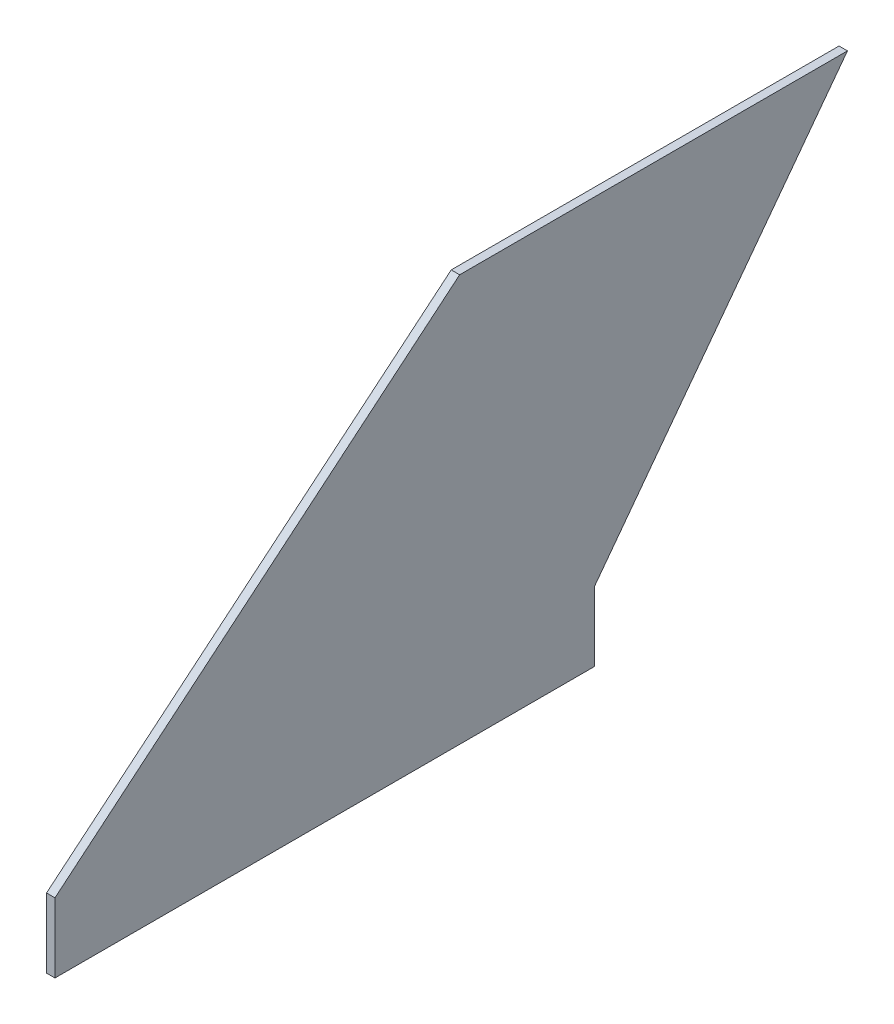
ISO-10303-21;
HEADER;
FILE_DESCRIPTION(('STEP AP214'),'2;1');
FILE_NAME('part.step','',(''),(''),'','','');
FILE_SCHEMA(('AUTOMOTIVE_DESIGN { 1 0 10303 214 1 1 1 1 }'));
ENDSEC;
DATA;
#1=APPLICATION_CONTEXT('core data for automotive mechanical design processes');
#2=APPLICATION_PROTOCOL_DEFINITION('international standard','automotive_design',2000,#1);
#3=PRODUCT_CONTEXT('',#1,'mechanical');
#4=PRODUCT('Part','Part','',(#3));
#5=PRODUCT_RELATED_PRODUCT_CATEGORY('part','',(#4));
#6=PRODUCT_DEFINITION_FORMATION('','',#4);
#7=PRODUCT_DEFINITION_CONTEXT('part definition',#1,'design');
#8=PRODUCT_DEFINITION('design','',#6,#7);
#9=PRODUCT_DEFINITION_SHAPE('','',#8);
#10=(LENGTH_UNIT() NAMED_UNIT(*) SI_UNIT(.MILLI.,.METRE.));
#11=(NAMED_UNIT(*) PLANE_ANGLE_UNIT() SI_UNIT($,.RADIAN.));
#12=(NAMED_UNIT(*) SI_UNIT($,.STERADIAN.) SOLID_ANGLE_UNIT());
#13=UNCERTAINTY_MEASURE_WITH_UNIT(LENGTH_MEASURE(1.E-05),#10,'distance_accuracy_value','');
#14=(GEOMETRIC_REPRESENTATION_CONTEXT(3) GLOBAL_UNCERTAINTY_ASSIGNED_CONTEXT((#13)) GLOBAL_UNIT_ASSIGNED_CONTEXT((#10,
#11,#12)) REPRESENTATION_CONTEXT('',''));
#15=CARTESIAN_POINT('',(0.,0.,0.));
#16=DIRECTION('',(0.,0.,1.));
#17=DIRECTION('',(1.,0.,0.));
#18=AXIS2_PLACEMENT_3D('',#15,#16,#17);
#19=CARTESIAN_POINT('',(3.175,127.,-298.45));
#20=DIRECTION('',(0.,0.6,0.8));
#21=DIRECTION('',(0.,-0.8,0.6));
#22=AXIS2_PLACEMENT_3D('',#19,#20,#21);
#23=PLANE('',#22);
#24=DIRECTION('',(0.,0.8,-0.6));
#25=VECTOR('',#24,1.);
#26=CARTESIAN_POINT('',(0.,127.,-298.45));
#27=LINE('',#26,#25);
#28=CARTESIAN_POINT('',(0.,0.,-203.2));
#29=VERTEX_POINT('',#28);
#30=CARTESIAN_POINT('',(0.,127.,-298.45));
#31=VERTEX_POINT('',#30);
#32=EDGE_CURVE('E129',#29,#31,#27,.T.);
#33=ORIENTED_EDGE('',*,*,#32,.T.);
#34=DIRECTION('',(-1.,0.,0.));
#35=VECTOR('',#34,1.);
#36=CARTESIAN_POINT('',(3.175,127.,-298.45));
#37=LINE('',#36,#35);
#38=CARTESIAN_POINT('',(3.175,127.,-298.45));
#39=VERTEX_POINT('',#38);
#40=EDGE_CURVE('E11',#39,#31,#37,.T.);
#41=ORIENTED_EDGE('',*,*,#40,.F.);
#42=DIRECTION('',(0.,0.8,-0.6));
#43=VECTOR('',#42,1.);
#44=CARTESIAN_POINT('',(3.175,127.,-298.45));
#45=LINE('',#44,#43);
#46=CARTESIAN_POINT('',(3.175,0.,-203.2));
#47=VERTEX_POINT('',#46);
#48=EDGE_CURVE('E139',#47,#39,#45,.T.);
#49=ORIENTED_EDGE('',*,*,#48,.F.);
#50=DIRECTION('',(-1.,0.,0.));
#51=VECTOR('',#50,1.);
#52=CARTESIAN_POINT('',(3.175,0.,-203.2));
#53=LINE('',#52,#51);
#54=EDGE_CURVE('E125',#47,#29,#53,.T.);
#55=ORIENTED_EDGE('',*,*,#54,.T.);
#56=EDGE_LOOP('',(#33,#41,#49,#55));
#57=FACE_BOUND('',#56,.T.);
#58=ADVANCED_FACE('F45',(#57),#23,.F.);
#59=CARTESIAN_POINT('',(3.175,127.,-152.4));
#60=DIRECTION('',(0.,-1.,0.));
#61=DIRECTION('',(0.,0.,-1.));
#62=AXIS2_PLACEMENT_3D('',#59,#60,#61);
#63=PLANE('',#62);
#64=DIRECTION('',(0.,0.,1.));
#65=VECTOR('',#64,1.);
#66=CARTESIAN_POINT('',(0.,127.,-152.4));
#67=LINE('',#66,#65);
#68=CARTESIAN_POINT('',(0.,127.,-152.4));
#69=VERTEX_POINT('',#68);
#70=EDGE_CURVE('E132',#31,#69,#67,.T.);
#71=ORIENTED_EDGE('',*,*,#70,.T.);
#72=DIRECTION('',(-1.,0.,0.));
#73=VECTOR('',#72,1.);
#74=CARTESIAN_POINT('',(3.175,127.,-152.4));
#75=LINE('',#74,#73);
#76=CARTESIAN_POINT('',(3.175,127.,-152.4));
#77=VERTEX_POINT('',#76);
#78=EDGE_CURVE('E53',#77,#69,#75,.T.);
#79=ORIENTED_EDGE('',*,*,#78,.F.);
#80=DIRECTION('',(0.,0.,1.));
#81=VECTOR('',#80,1.);
#82=CARTESIAN_POINT('',(3.175,127.,-152.4));
#83=LINE('',#82,#81);
#84=EDGE_CURVE('E98',#39,#77,#83,.T.);
#85=ORIENTED_EDGE('',*,*,#84,.F.);
#86=ORIENTED_EDGE('',*,*,#40,.T.);
#87=EDGE_LOOP('',(#71,#79,#85,#86));
#88=FACE_BOUND('',#87,.T.);
#89=ADVANCED_FACE('F163',(#88),#63,.F.);
#90=CARTESIAN_POINT('',(3.175,0.,0.));
#91=DIRECTION('',(0.,-0.768221279597376,-0.64018439966448));
#92=DIRECTION('',(0.,0.64018439966448,-0.768221279597376));
#93=AXIS2_PLACEMENT_3D('',#90,#91,#92);
#94=PLANE('',#93);
#95=DIRECTION('',(0.,-0.64018439966448,0.768221279597376));
#96=VECTOR('',#95,1.);
#97=CARTESIAN_POINT('',(0.,0.,0.));
#98=LINE('',#97,#96);
#99=CARTESIAN_POINT('',(0.,0.,0.));
#100=VERTEX_POINT('',#99);
#101=EDGE_CURVE('E134',#69,#100,#98,.T.);
#102=ORIENTED_EDGE('',*,*,#101,.T.);
#103=DIRECTION('',(-1.,0.,0.));
#104=VECTOR('',#103,1.);
#105=CARTESIAN_POINT('',(3.175,0.,0.));
#106=LINE('',#105,#104);
#107=CARTESIAN_POINT('',(3.175,0.,0.));
#108=VERTEX_POINT('',#107);
#109=EDGE_CURVE('E120',#108,#100,#106,.T.);
#110=ORIENTED_EDGE('',*,*,#109,.F.);
#111=DIRECTION('',(0.,-0.64018439966448,0.768221279597376));
#112=VECTOR('',#111,1.);
#113=CARTESIAN_POINT('',(3.175,0.,0.));
#114=LINE('',#113,#112);
#115=EDGE_CURVE('E111',#77,#108,#114,.T.);
#116=ORIENTED_EDGE('',*,*,#115,.F.);
#117=ORIENTED_EDGE('',*,*,#78,.T.);
#118=EDGE_LOOP('',(#102,#110,#116,#117));
#119=FACE_BOUND('',#118,.T.);
#120=ADVANCED_FACE('F145',(#119),#94,.F.);
#121=CARTESIAN_POINT('',(3.175,-26.1493,0.));
#122=DIRECTION('',(0.,0.,-1.));
#123=DIRECTION('',(-1.,0.,0.));
#124=AXIS2_PLACEMENT_3D('',#121,#122,#123);
#125=PLANE('',#124);
#126=DIRECTION('',(0.,-1.,0.));
#127=VECTOR('',#126,1.);
#128=CARTESIAN_POINT('',(0.,-26.1493,0.));
#129=LINE('',#128,#127);
#130=CARTESIAN_POINT('',(0.,-26.1493,0.));
#131=VERTEX_POINT('',#130);
#132=EDGE_CURVE('E119',#100,#131,#129,.T.);
#133=ORIENTED_EDGE('',*,*,#132,.T.);
#134=DIRECTION('',(-1.,0.,0.));
#135=VECTOR('',#134,1.);
#136=CARTESIAN_POINT('',(3.175,-26.1493,0.));
#137=LINE('',#136,#135);
#138=CARTESIAN_POINT('',(3.175,-26.1493,0.));
#139=VERTEX_POINT('',#138);
#140=EDGE_CURVE('E116',#139,#131,#137,.T.);
#141=ORIENTED_EDGE('',*,*,#140,.F.);
#142=DIRECTION('',(0.,-1.,0.));
#143=VECTOR('',#142,1.);
#144=CARTESIAN_POINT('',(3.175,-26.1493,0.));
#145=LINE('',#144,#143);
#146=EDGE_CURVE('E105',#108,#139,#145,.T.);
#147=ORIENTED_EDGE('',*,*,#146,.F.);
#148=ORIENTED_EDGE('',*,*,#109,.T.);
#149=EDGE_LOOP('',(#133,#141,#147,#148));
#150=FACE_BOUND('',#149,.T.);
#151=ADVANCED_FACE('F117',(#150),#125,.F.);
#152=CARTESIAN_POINT('',(3.175,-26.1493,0.));
#153=DIRECTION('',(0.,1.,0.));
#154=DIRECTION('',(0.,0.,1.));
#155=AXIS2_PLACEMENT_3D('',#152,#153,#154);
#156=PLANE('',#155);
#157=DIRECTION('',(0.,0.,-1.));
#158=VECTOR('',#157,1.);
#159=CARTESIAN_POINT('',(0.,-26.1493,0.));
#160=LINE('',#159,#158);
#161=CARTESIAN_POINT('',(0.,-26.1493,-203.2));
#162=VERTEX_POINT('',#161);
#163=EDGE_CURVE('E84',#131,#162,#160,.T.);
#164=ORIENTED_EDGE('',*,*,#163,.T.);
#165=DIRECTION('',(-1.,0.,0.));
#166=VECTOR('',#165,1.);
#167=CARTESIAN_POINT('',(3.175,-26.1493,-203.2));
#168=LINE('',#167,#166);
#169=CARTESIAN_POINT('',(3.175,-26.1493,-203.2));
#170=VERTEX_POINT('',#169);
#171=EDGE_CURVE('E121',#170,#162,#168,.T.);
#172=ORIENTED_EDGE('',*,*,#171,.F.);
#173=DIRECTION('',(0.,0.,-1.));
#174=VECTOR('',#173,1.);
#175=CARTESIAN_POINT('',(3.175,-26.1493,0.));
#176=LINE('',#175,#174);
#177=EDGE_CURVE('E109',#139,#170,#176,.T.);
#178=ORIENTED_EDGE('',*,*,#177,.F.);
#179=ORIENTED_EDGE('',*,*,#140,.T.);
#180=EDGE_LOOP('',(#164,#172,#178,#179));
#181=FACE_BOUND('',#180,.T.);
#182=ADVANCED_FACE('F123',(#181),#156,.F.);
#183=CARTESIAN_POINT('',(3.175,-26.1493,-203.2));
#184=DIRECTION('',(0.,0.,1.));
#185=DIRECTION('',(1.,0.,0.));
#186=AXIS2_PLACEMENT_3D('',#183,#184,#185);
#187=PLANE('',#186);
#188=DIRECTION('',(0.,1.,0.));
#189=VECTOR('',#188,1.);
#190=CARTESIAN_POINT('',(0.,-26.1493,-203.2));
#191=LINE('',#190,#189);
#192=EDGE_CURVE('E90',#162,#29,#191,.T.);
#193=ORIENTED_EDGE('',*,*,#192,.T.);
#194=ORIENTED_EDGE('',*,*,#54,.F.);
#195=DIRECTION('',(0.,1.,0.));
#196=VECTOR('',#195,1.);
#197=CARTESIAN_POINT('',(3.175,-26.1493,-203.2));
#198=LINE('',#197,#196);
#199=EDGE_CURVE('E61',#170,#47,#198,.T.);
#200=ORIENTED_EDGE('',*,*,#199,.F.);
#201=ORIENTED_EDGE('',*,*,#171,.T.);
#202=EDGE_LOOP('',(#193,#194,#200,#201));
#203=FACE_BOUND('',#202,.T.);
#204=ADVANCED_FACE('F152',(#203),#187,.F.);
#205=CARTESIAN_POINT('',(3.175,0.,0.));
#206=DIRECTION('',(1.,0.,0.));
#207=DIRECTION('',(0.,0.,-1.));
#208=AXIS2_PLACEMENT_3D('',#205,#206,#207);
#209=PLANE('',#208);
#210=ORIENTED_EDGE('',*,*,#48,.T.);
#211=ORIENTED_EDGE('',*,*,#84,.T.);
#212=ORIENTED_EDGE('',*,*,#115,.T.);
#213=ORIENTED_EDGE('',*,*,#146,.T.);
#214=ORIENTED_EDGE('',*,*,#177,.T.);
#215=ORIENTED_EDGE('',*,*,#199,.T.);
#216=EDGE_LOOP('',(#210,#211,#212,#213,#214,#215));
#217=FACE_BOUND('',#216,.T.);
#218=ADVANCED_FACE('F107',(#217),#209,.T.);
#219=CARTESIAN_POINT('',(0.,0.,0.));
#220=DIRECTION('',(1.,0.,0.));
#221=DIRECTION('',(0.,0.,-1.));
#222=AXIS2_PLACEMENT_3D('',#219,#220,#221);
#223=PLANE('',#222);
#224=ORIENTED_EDGE('',*,*,#32,.F.);
#225=ORIENTED_EDGE('',*,*,#192,.F.);
#226=ORIENTED_EDGE('',*,*,#163,.F.);
#227=ORIENTED_EDGE('',*,*,#132,.F.);
#228=ORIENTED_EDGE('',*,*,#101,.F.);
#229=ORIENTED_EDGE('',*,*,#70,.F.);
#230=EDGE_LOOP('',(#224,#225,#226,#227,#228,#229));
#231=FACE_BOUND('',#230,.T.);
#232=ADVANCED_FACE('F148',(#231),#223,.F.);
#233=CLOSED_SHELL('',(#58,#89,#120,#151,#182,#204,#218,#232));
#234=MANIFOLD_SOLID_BREP('B2',#233);
#235=ADVANCED_BREP_SHAPE_REPRESENTATION('',(#18,#234),#14);
#236=SHAPE_DEFINITION_REPRESENTATION(#9,#235);
ENDSEC;
END-ISO-10303-21;
